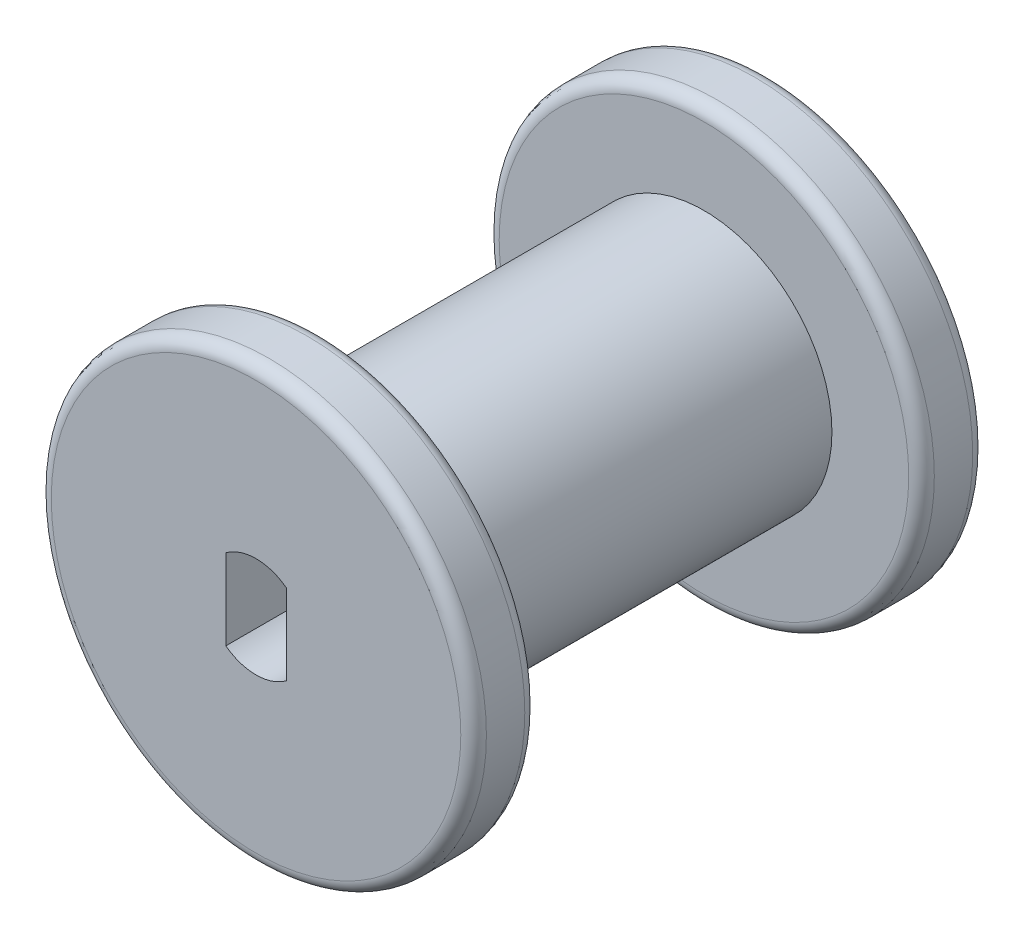
ISO-10303-21;
HEADER;
FILE_DESCRIPTION(('STEP AP214'),'2;1');
FILE_NAME('part.step','',(''),(''),'','','');
FILE_SCHEMA(('AUTOMOTIVE_DESIGN { 1 0 10303 214 1 1 1 1 }'));
ENDSEC;
DATA;
#1=APPLICATION_CONTEXT('core data for automotive mechanical design processes');
#2=APPLICATION_PROTOCOL_DEFINITION('international standard','automotive_design',2000,#1);
#3=PRODUCT_CONTEXT('',#1,'mechanical');
#4=PRODUCT('Part','Part','',(#3));
#5=PRODUCT_RELATED_PRODUCT_CATEGORY('part','',(#4));
#6=PRODUCT_DEFINITION_FORMATION('','',#4);
#7=PRODUCT_DEFINITION_CONTEXT('part definition',#1,'design');
#8=PRODUCT_DEFINITION('design','',#6,#7);
#9=PRODUCT_DEFINITION_SHAPE('','',#8);
#10=(LENGTH_UNIT() NAMED_UNIT(*) SI_UNIT(.MILLI.,.METRE.));
#11=(NAMED_UNIT(*) PLANE_ANGLE_UNIT() SI_UNIT($,.RADIAN.));
#12=(NAMED_UNIT(*) SI_UNIT($,.STERADIAN.) SOLID_ANGLE_UNIT());
#13=UNCERTAINTY_MEASURE_WITH_UNIT(LENGTH_MEASURE(1.E-05),#10,'distance_accuracy_value','');
#14=(GEOMETRIC_REPRESENTATION_CONTEXT(3) GLOBAL_UNCERTAINTY_ASSIGNED_CONTEXT((#13)) GLOBAL_UNIT_ASSIGNED_CONTEXT((#10,
#11,#12)) REPRESENTATION_CONTEXT('',''));
#15=CARTESIAN_POINT('',(0.,0.,0.));
#16=DIRECTION('',(0.,0.,1.));
#17=DIRECTION('',(1.,0.,0.));
#18=AXIS2_PLACEMENT_3D('',#15,#16,#17);
#19=CARTESIAN_POINT('',(0.,0.,25.4));
#20=DIRECTION('',(0.,0.,-1.));
#21=DIRECTION('',(-1.,0.,0.));
#22=AXIS2_PLACEMENT_3D('',#19,#20,#21);
#23=CYLINDRICAL_SURFACE('',#22,10.795);
#24=CARTESIAN_POINT('',(0.,0.,0.635));
#25=DIRECTION('',(0.,0.,1.));
#26=DIRECTION('',(1.,0.,0.));
#27=AXIS2_PLACEMENT_3D('',#24,#25,#26);
#28=CIRCLE('',#27,10.795);
#29=CARTESIAN_POINT('',(10.795,0.,0.635));
#30=VERTEX_POINT('',#29);
#31=EDGE_CURVE('E115',#30,#30,#28,.T.);
#32=ORIENTED_EDGE('',*,*,#31,.T.);
#33=EDGE_LOOP('',(#32));
#34=FACE_BOUND('',#33,.T.);
#35=CARTESIAN_POINT('',(0.,0.,2.54));
#36=DIRECTION('',(0.,0.,1.));
#37=DIRECTION('',(1.,0.,0.));
#38=AXIS2_PLACEMENT_3D('',#35,#36,#37);
#39=CIRCLE('',#38,10.795);
#40=CARTESIAN_POINT('',(10.795,0.,2.54));
#41=VERTEX_POINT('',#40);
#42=EDGE_CURVE('E90',#41,#41,#39,.F.);
#43=ORIENTED_EDGE('',*,*,#42,.T.);
#44=EDGE_LOOP('',(#43));
#45=FACE_BOUND('',#44,.T.);
#46=ADVANCED_FACE('F33',(#34,#45),#23,.T.);
#47=CARTESIAN_POINT('',(0.,0.,25.4));
#48=DIRECTION('',(0.,0.,1.));
#49=DIRECTION('',(1.,0.,0.));
#50=AXIS2_PLACEMENT_3D('',#47,#48,#49);
#51=PLANE('',#50);
#52=CARTESIAN_POINT('',(0.,0.,25.4));
#53=DIRECTION('',(0.,0.,1.));
#54=DIRECTION('',(1.,0.,0.));
#55=AXIS2_PLACEMENT_3D('',#52,#53,#54);
#56=CIRCLE('',#55,10.16);
#57=CARTESIAN_POINT('',(10.16,0.,25.4));
#58=VERTEX_POINT('',#57);
#59=EDGE_CURVE('E124',#58,#58,#56,.T.);
#60=ORIENTED_EDGE('',*,*,#59,.T.);
#61=EDGE_LOOP('',(#60));
#62=FACE_BOUND('',#61,.T.);
#63=DIRECTION('',(0.,1.,0.));
#64=VECTOR('',#63,1.);
#65=CARTESIAN_POINT('',(1.5,-2.00000000000001,25.4));
#66=LINE('',#65,#64);
#67=CARTESIAN_POINT('',(1.5,-2.00000000000001,25.4));
#68=VERTEX_POINT('',#67);
#69=CARTESIAN_POINT('',(1.5,2.00000000000001,25.4));
#70=VERTEX_POINT('',#69);
#71=EDGE_CURVE('E82',#68,#70,#66,.T.);
#72=ORIENTED_EDGE('',*,*,#71,.F.);
#73=CARTESIAN_POINT('',(0.,0.,25.4));
#74=DIRECTION('',(0.,0.,1.));
#75=DIRECTION('',(1.,0.,0.));
#76=AXIS2_PLACEMENT_3D('',#73,#74,#75);
#77=CIRCLE('',#76,2.50000000000001);
#78=CARTESIAN_POINT('',(-1.5,-2.00000000000001,25.4));
#79=VERTEX_POINT('',#78);
#80=EDGE_CURVE('E74',#79,#68,#77,.T.);
#81=ORIENTED_EDGE('',*,*,#80,.F.);
#82=DIRECTION('',(0.,-1.,0.));
#83=VECTOR('',#82,1.);
#84=CARTESIAN_POINT('',(-1.5,-2.00000000000001,25.4));
#85=LINE('',#84,#83);
#86=CARTESIAN_POINT('',(-1.5,2.00000000000001,25.4));
#87=VERTEX_POINT('',#86);
#88=EDGE_CURVE('E97',#87,#79,#85,.T.);
#89=ORIENTED_EDGE('',*,*,#88,.F.);
#90=CARTESIAN_POINT('',(0.,0.,25.4));
#91=DIRECTION('',(0.,0.,1.));
#92=DIRECTION('',(1.,0.,0.));
#93=AXIS2_PLACEMENT_3D('',#90,#91,#92);
#94=CIRCLE('',#93,2.50000000000001);
#95=EDGE_CURVE('E95',#70,#87,#94,.T.);
#96=ORIENTED_EDGE('',*,*,#95,.F.);
#97=EDGE_LOOP('',(#72,#81,#89,#96));
#98=FACE_BOUND('',#97,.T.);
#99=ADVANCED_FACE('F94',(#62,#98),#51,.T.);
#100=CARTESIAN_POINT('',(0.,0.,0.));
#101=DIRECTION('',(0.,0.,1.));
#102=DIRECTION('',(1.,0.,0.));
#103=AXIS2_PLACEMENT_3D('',#100,#101,#102);
#104=PLANE('',#103);
#105=CARTESIAN_POINT('',(0.,0.,0.));
#106=DIRECTION('',(0.,0.,1.));
#107=DIRECTION('',(1.,0.,0.));
#108=AXIS2_PLACEMENT_3D('',#105,#106,#107);
#109=CIRCLE('',#108,10.16);
#110=CARTESIAN_POINT('',(10.16,0.,0.));
#111=VERTEX_POINT('',#110);
#112=EDGE_CURVE('E118',#111,#111,#109,.F.);
#113=ORIENTED_EDGE('',*,*,#112,.T.);
#114=EDGE_LOOP('',(#113));
#115=FACE_BOUND('',#114,.T.);
#116=CARTESIAN_POINT('',(0.,0.,0.));
#117=DIRECTION('',(0.,0.,1.));
#118=DIRECTION('',(1.,0.,0.));
#119=AXIS2_PLACEMENT_3D('',#116,#117,#118);
#120=CIRCLE('',#119,2.50000000000001);
#121=CARTESIAN_POINT('',(-1.5,-2.00000000000001,0.));
#122=VERTEX_POINT('',#121);
#123=CARTESIAN_POINT('',(1.5,-2.00000000000001,0.));
#124=VERTEX_POINT('',#123);
#125=EDGE_CURVE('E56',#122,#124,#120,.T.);
#126=ORIENTED_EDGE('',*,*,#125,.T.);
#127=DIRECTION('',(0.,1.,0.));
#128=VECTOR('',#127,1.);
#129=CARTESIAN_POINT('',(1.5,-2.00000000000001,0.));
#130=LINE('',#129,#128);
#131=CARTESIAN_POINT('',(1.5,2.00000000000001,0.));
#132=VERTEX_POINT('',#131);
#133=EDGE_CURVE('E89',#124,#132,#130,.T.);
#134=ORIENTED_EDGE('',*,*,#133,.T.);
#135=CARTESIAN_POINT('',(0.,0.,0.));
#136=DIRECTION('',(0.,0.,1.));
#137=DIRECTION('',(1.,0.,0.));
#138=AXIS2_PLACEMENT_3D('',#135,#136,#137);
#139=CIRCLE('',#138,2.50000000000001);
#140=CARTESIAN_POINT('',(-1.5,2.00000000000001,0.));
#141=VERTEX_POINT('',#140);
#142=EDGE_CURVE('E105',#132,#141,#139,.T.);
#143=ORIENTED_EDGE('',*,*,#142,.T.);
#144=DIRECTION('',(0.,-1.,0.));
#145=VECTOR('',#144,1.);
#146=CARTESIAN_POINT('',(-1.5,-2.00000000000001,0.));
#147=LINE('',#146,#145);
#148=EDGE_CURVE('E83',#141,#122,#147,.T.);
#149=ORIENTED_EDGE('',*,*,#148,.T.);
#150=EDGE_LOOP('',(#126,#134,#143,#149));
#151=FACE_BOUND('',#150,.T.);
#152=ADVANCED_FACE('F142',(#115,#151),#104,.F.);
#153=CARTESIAN_POINT('',(0.,0.,24.765));
#154=DIRECTION('',(0.,0.,1.));
#155=DIRECTION('',(1.,0.,0.));
#156=AXIS2_PLACEMENT_3D('',#153,#154,#155);
#157=CIRCLE('',#156,10.795);
#158=CARTESIAN_POINT('',(10.795,0.,24.765));
#159=VERTEX_POINT('',#158);
#160=EDGE_CURVE('E41',#159,#159,#157,.F.);
#161=ORIENTED_EDGE('',*,*,#160,.T.);
#162=EDGE_LOOP('',(#161));
#163=FACE_BOUND('',#162,.T.);
#164=CARTESIAN_POINT('',(0.,0.,22.86));
#165=DIRECTION('',(0.,0.,1.));
#166=DIRECTION('',(1.,0.,0.));
#167=AXIS2_PLACEMENT_3D('',#164,#165,#166);
#168=CIRCLE('',#167,10.795);
#169=CARTESIAN_POINT('',(10.795,0.,22.86));
#170=VERTEX_POINT('',#169);
#171=EDGE_CURVE('E127',#170,#170,#168,.T.);
#172=ORIENTED_EDGE('',*,*,#171,.T.);
#173=EDGE_LOOP('',(#172));
#174=FACE_BOUND('',#173,.T.);
#175=ADVANCED_FACE('F132',(#163,#174),#23,.T.);
#176=CARTESIAN_POINT('',(0.,0.,25.4));
#177=DIRECTION('',(0.,0.,-1.));
#178=DIRECTION('',(-1.,0.,0.));
#179=AXIS2_PLACEMENT_3D('',#176,#177,#178);
#180=CYLINDRICAL_SURFACE('',#179,2.50000000000001);
#181=ORIENTED_EDGE('',*,*,#125,.F.);
#182=DIRECTION('',(0.,0.,-1.));
#183=VECTOR('',#182,1.);
#184=CARTESIAN_POINT('',(-1.5,-2.00000000000001,25.4));
#185=LINE('',#184,#183);
#186=EDGE_CURVE('E78',#79,#122,#185,.T.);
#187=ORIENTED_EDGE('',*,*,#186,.F.);
#188=ORIENTED_EDGE('',*,*,#80,.T.);
#189=DIRECTION('',(0.,0.,-1.));
#190=VECTOR('',#189,1.);
#191=CARTESIAN_POINT('',(1.5,-2.00000000000001,25.4));
#192=LINE('',#191,#190);
#193=EDGE_CURVE('E77',#68,#124,#192,.T.);
#194=ORIENTED_EDGE('',*,*,#193,.T.);
#195=EDGE_LOOP('',(#181,#187,#188,#194));
#196=FACE_BOUND('',#195,.T.);
#197=ADVANCED_FACE('F76',(#196),#180,.F.);
#198=CARTESIAN_POINT('',(1.5,-2.00000000000001,25.4));
#199=DIRECTION('',(-1.,0.,0.));
#200=DIRECTION('',(0.,0.,1.));
#201=AXIS2_PLACEMENT_3D('',#198,#199,#200);
#202=PLANE('',#201);
#203=ORIENTED_EDGE('',*,*,#133,.F.);
#204=ORIENTED_EDGE('',*,*,#193,.F.);
#205=ORIENTED_EDGE('',*,*,#71,.T.);
#206=DIRECTION('',(0.,0.,-1.));
#207=VECTOR('',#206,1.);
#208=CARTESIAN_POINT('',(1.5,2.00000000000001,25.4));
#209=LINE('',#208,#207);
#210=EDGE_CURVE('E91',#70,#132,#209,.T.);
#211=ORIENTED_EDGE('',*,*,#210,.T.);
#212=EDGE_LOOP('',(#203,#204,#205,#211));
#213=FACE_BOUND('',#212,.T.);
#214=ADVANCED_FACE('F86',(#213),#202,.T.);
#215=CARTESIAN_POINT('',(0.,0.,25.4));
#216=DIRECTION('',(0.,0.,-1.));
#217=DIRECTION('',(-1.,0.,0.));
#218=AXIS2_PLACEMENT_3D('',#215,#216,#217);
#219=CYLINDRICAL_SURFACE('',#218,2.50000000000001);
#220=ORIENTED_EDGE('',*,*,#142,.F.);
#221=ORIENTED_EDGE('',*,*,#210,.F.);
#222=ORIENTED_EDGE('',*,*,#95,.T.);
#223=DIRECTION('',(0.,0.,-1.));
#224=VECTOR('',#223,1.);
#225=CARTESIAN_POINT('',(-1.5,2.00000000000001,25.4));
#226=LINE('',#225,#224);
#227=EDGE_CURVE('E48',#87,#141,#226,.T.);
#228=ORIENTED_EDGE('',*,*,#227,.T.);
#229=EDGE_LOOP('',(#220,#221,#222,#228));
#230=FACE_BOUND('',#229,.T.);
#231=ADVANCED_FACE('F194',(#230),#219,.F.);
#232=CARTESIAN_POINT('',(-1.5,-2.00000000000001,25.4));
#233=DIRECTION('',(1.,0.,0.));
#234=DIRECTION('',(0.,0.,-1.));
#235=AXIS2_PLACEMENT_3D('',#232,#233,#234);
#236=PLANE('',#235);
#237=ORIENTED_EDGE('',*,*,#148,.F.);
#238=ORIENTED_EDGE('',*,*,#227,.F.);
#239=ORIENTED_EDGE('',*,*,#88,.T.);
#240=ORIENTED_EDGE('',*,*,#186,.T.);
#241=EDGE_LOOP('',(#237,#238,#239,#240));
#242=FACE_BOUND('',#241,.T.);
#243=ADVANCED_FACE('F173',(#242),#236,.T.);
#244=CARTESIAN_POINT('',(0.,0.,3.175));
#245=DIRECTION('',(0.,0.,1.));
#246=DIRECTION('',(1.,0.,0.));
#247=AXIS2_PLACEMENT_3D('',#244,#245,#246);
#248=PLANE('',#247);
#249=CARTESIAN_POINT('',(0.,0.,3.175));
#250=DIRECTION('',(0.,0.,1.));
#251=DIRECTION('',(1.,0.,0.));
#252=AXIS2_PLACEMENT_3D('',#249,#250,#251);
#253=CIRCLE('',#252,10.16);
#254=CARTESIAN_POINT('',(10.16,0.,3.175));
#255=VERTEX_POINT('',#254);
#256=EDGE_CURVE('E121',#255,#255,#253,.T.);
#257=ORIENTED_EDGE('',*,*,#256,.T.);
#258=EDGE_LOOP('',(#257));
#259=FACE_BOUND('',#258,.T.);
#260=CARTESIAN_POINT('',(0.,0.,3.175));
#261=DIRECTION('',(0.,0.,1.));
#262=DIRECTION('',(1.,0.,0.));
#263=AXIS2_PLACEMENT_3D('',#260,#261,#262);
#264=CIRCLE('',#263,6.35);
#265=CARTESIAN_POINT('',(6.35,0.,3.175));
#266=VERTEX_POINT('',#265);
#267=EDGE_CURVE('E103',#266,#266,#264,.T.);
#268=ORIENTED_EDGE('',*,*,#267,.F.);
#269=EDGE_LOOP('',(#268));
#270=FACE_BOUND('',#269,.T.);
#271=ADVANCED_FACE('F169',(#259,#270),#248,.T.);
#272=CARTESIAN_POINT('',(0.,0.,22.225));
#273=DIRECTION('',(0.,0.,1.));
#274=DIRECTION('',(1.,0.,0.));
#275=AXIS2_PLACEMENT_3D('',#272,#273,#274);
#276=PLANE('',#275);
#277=CARTESIAN_POINT('',(0.,0.,22.225));
#278=DIRECTION('',(0.,0.,1.));
#279=DIRECTION('',(1.,0.,0.));
#280=AXIS2_PLACEMENT_3D('',#277,#278,#279);
#281=CIRCLE('',#280,10.16);
#282=CARTESIAN_POINT('',(10.16,0.,22.225));
#283=VERTEX_POINT('',#282);
#284=EDGE_CURVE('E11',#283,#283,#281,.F.);
#285=ORIENTED_EDGE('',*,*,#284,.T.);
#286=EDGE_LOOP('',(#285));
#287=FACE_BOUND('',#286,.T.);
#288=CARTESIAN_POINT('',(0.,0.,22.225));
#289=DIRECTION('',(0.,0.,1.));
#290=DIRECTION('',(1.,0.,0.));
#291=AXIS2_PLACEMENT_3D('',#288,#289,#290);
#292=CIRCLE('',#291,6.35);
#293=CARTESIAN_POINT('',(6.35,0.,22.225));
#294=VERTEX_POINT('',#293);
#295=EDGE_CURVE('E178',#294,#294,#292,.T.);
#296=ORIENTED_EDGE('',*,*,#295,.T.);
#297=EDGE_LOOP('',(#296));
#298=FACE_BOUND('',#297,.T.);
#299=ADVANCED_FACE('F172',(#287,#298),#276,.F.);
#300=CARTESIAN_POINT('',(0.,0.,3.175));
#301=DIRECTION('',(0.,0.,1.));
#302=DIRECTION('',(1.,0.,0.));
#303=AXIS2_PLACEMENT_3D('',#300,#301,#302);
#304=CYLINDRICAL_SURFACE('',#303,6.35);
#305=ORIENTED_EDGE('',*,*,#267,.T.);
#306=EDGE_LOOP('',(#305));
#307=FACE_BOUND('',#306,.T.);
#308=ORIENTED_EDGE('',*,*,#295,.F.);
#309=EDGE_LOOP('',(#308));
#310=FACE_BOUND('',#309,.T.);
#311=ADVANCED_FACE('F159',(#307,#310),#304,.T.);
#312=CARTESIAN_POINT('',(0.,0.,0.635));
#313=DIRECTION('',(0.,0.,1.));
#314=DIRECTION('',(1.,0.,0.));
#315=AXIS2_PLACEMENT_3D('',#312,#313,#314);
#316=TOROIDAL_SURFACE('',#315,10.16,0.635);
#317=ORIENTED_EDGE('',*,*,#112,.F.);
#318=EDGE_LOOP('',(#317));
#319=FACE_BOUND('',#318,.T.);
#320=ORIENTED_EDGE('',*,*,#31,.F.);
#321=EDGE_LOOP('',(#320));
#322=FACE_BOUND('',#321,.T.);
#323=ADVANCED_FACE('F156',(#319,#322),#316,.T.);
#324=CARTESIAN_POINT('',(0.,0.,2.54));
#325=DIRECTION('',(0.,0.,1.));
#326=DIRECTION('',(1.,0.,0.));
#327=AXIS2_PLACEMENT_3D('',#324,#325,#326);
#328=TOROIDAL_SURFACE('',#327,10.16,0.635);
#329=ORIENTED_EDGE('',*,*,#42,.F.);
#330=EDGE_LOOP('',(#329));
#331=FACE_BOUND('',#330,.T.);
#332=ORIENTED_EDGE('',*,*,#256,.F.);
#333=EDGE_LOOP('',(#332));
#334=FACE_BOUND('',#333,.T.);
#335=ADVANCED_FACE('F138',(#331,#334),#328,.T.);
#336=CARTESIAN_POINT('',(0.,0.,24.765));
#337=DIRECTION('',(0.,0.,1.));
#338=DIRECTION('',(1.,0.,0.));
#339=AXIS2_PLACEMENT_3D('',#336,#337,#338);
#340=TOROIDAL_SURFACE('',#339,10.16,0.635);
#341=ORIENTED_EDGE('',*,*,#160,.F.);
#342=EDGE_LOOP('',(#341));
#343=FACE_BOUND('',#342,.T.);
#344=ORIENTED_EDGE('',*,*,#59,.F.);
#345=EDGE_LOOP('',(#344));
#346=FACE_BOUND('',#345,.T.);
#347=ADVANCED_FACE('F135',(#343,#346),#340,.T.);
#348=CARTESIAN_POINT('',(0.,0.,22.86));
#349=DIRECTION('',(0.,0.,1.));
#350=DIRECTION('',(1.,0.,0.));
#351=AXIS2_PLACEMENT_3D('',#348,#349,#350);
#352=TOROIDAL_SURFACE('',#351,10.16,0.635);
#353=ORIENTED_EDGE('',*,*,#284,.F.);
#354=EDGE_LOOP('',(#353));
#355=FACE_BOUND('',#354,.T.);
#356=ORIENTED_EDGE('',*,*,#171,.F.);
#357=EDGE_LOOP('',(#356));
#358=FACE_BOUND('',#357,.T.);
#359=ADVANCED_FACE('F35',(#355,#358),#352,.T.);
#360=CLOSED_SHELL('',(#46,#99,#152,#175,#197,#214,#231,#243,#271,#299,#311,#323,#335,#347,#359));
#361=MANIFOLD_SOLID_BREP('B2',#360);
#362=ADVANCED_BREP_SHAPE_REPRESENTATION('',(#18,#361),#14);
#363=SHAPE_DEFINITION_REPRESENTATION(#9,#362);
ENDSEC;
END-ISO-10303-21;
